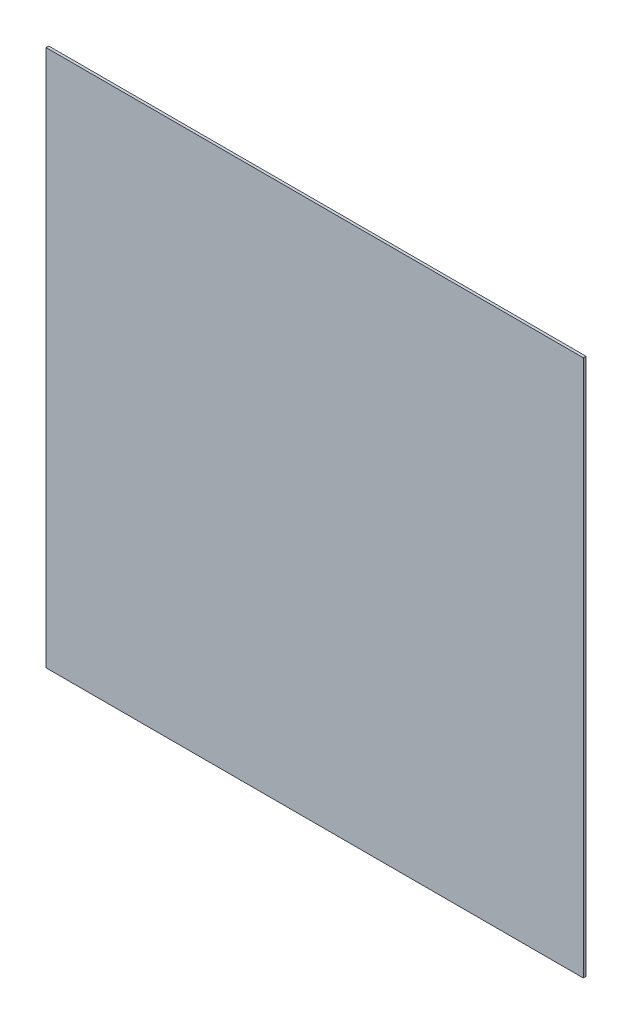
ISO-10303-21;
HEADER;
FILE_DESCRIPTION(('STEP AP214'),'2;1');
FILE_NAME('part.step','',(''),(''),'','','');
FILE_SCHEMA(('AUTOMOTIVE_DESIGN { 1 0 10303 214 1 1 1 1 }'));
ENDSEC;
DATA;
#1=APPLICATION_CONTEXT('core data for automotive mechanical design processes');
#2=APPLICATION_PROTOCOL_DEFINITION('international standard','automotive_design',2000,#1);
#3=PRODUCT_CONTEXT('',#1,'mechanical');
#4=PRODUCT('Part','Part','',(#3));
#5=PRODUCT_RELATED_PRODUCT_CATEGORY('part','',(#4));
#6=PRODUCT_DEFINITION_FORMATION('','',#4);
#7=PRODUCT_DEFINITION_CONTEXT('part definition',#1,'design');
#8=PRODUCT_DEFINITION('design','',#6,#7);
#9=PRODUCT_DEFINITION_SHAPE('','',#8);
#10=(LENGTH_UNIT() NAMED_UNIT(*) SI_UNIT(.MILLI.,.METRE.));
#11=(NAMED_UNIT(*) PLANE_ANGLE_UNIT() SI_UNIT($,.RADIAN.));
#12=(NAMED_UNIT(*) SI_UNIT($,.STERADIAN.) SOLID_ANGLE_UNIT());
#13=UNCERTAINTY_MEASURE_WITH_UNIT(LENGTH_MEASURE(1.E-05),#10,'distance_accuracy_value','');
#14=(GEOMETRIC_REPRESENTATION_CONTEXT(3) GLOBAL_UNCERTAINTY_ASSIGNED_CONTEXT((#13)) GLOBAL_UNIT_ASSIGNED_CONTEXT((#10,
#11,#12)) REPRESENTATION_CONTEXT('',''));
#15=CARTESIAN_POINT('',(0.,0.,0.));
#16=DIRECTION('',(0.,0.,1.));
#17=DIRECTION('',(1.,0.,0.));
#18=AXIS2_PLACEMENT_3D('',#15,#16,#17);
#19=CARTESIAN_POINT('',(0.,600.,0.));
#20=DIRECTION('',(1.,0.,0.));
#21=DIRECTION('',(0.,0.,-1.));
#22=AXIS2_PLACEMENT_3D('',#19,#20,#21);
#23=PLANE('',#22);
#24=DIRECTION('',(0.,0.,1.));
#25=VECTOR('',#24,1.);
#26=CARTESIAN_POINT('',(0.,0.,0.));
#27=LINE('',#26,#25);
#28=CARTESIAN_POINT('',(0.,0.,-3.));
#29=VERTEX_POINT('',#28);
#30=CARTESIAN_POINT('',(0.,0.,0.));
#31=VERTEX_POINT('',#30);
#32=EDGE_CURVE('E96',#29,#31,#27,.T.);
#33=ORIENTED_EDGE('',*,*,#32,.T.);
#34=DIRECTION('',(0.,-1.,0.));
#35=VECTOR('',#34,1.);
#36=CARTESIAN_POINT('',(0.,600.,0.));
#37=LINE('',#36,#35);
#38=CARTESIAN_POINT('',(0.,600.,0.));
#39=VERTEX_POINT('',#38);
#40=EDGE_CURVE('E11',#39,#31,#37,.T.);
#41=ORIENTED_EDGE('',*,*,#40,.F.);
#42=DIRECTION('',(0.,0.,1.));
#43=VECTOR('',#42,1.);
#44=CARTESIAN_POINT('',(0.,600.,0.));
#45=LINE('',#44,#43);
#46=CARTESIAN_POINT('',(0.,600.,-3.));
#47=VERTEX_POINT('',#46);
#48=EDGE_CURVE('E84',#47,#39,#45,.T.);
#49=ORIENTED_EDGE('',*,*,#48,.F.);
#50=DIRECTION('',(0.,-1.,0.));
#51=VECTOR('',#50,1.);
#52=CARTESIAN_POINT('',(0.,600.,-3.));
#53=LINE('',#52,#51);
#54=EDGE_CURVE('E92',#47,#29,#53,.T.);
#55=ORIENTED_EDGE('',*,*,#54,.T.);
#56=EDGE_LOOP('',(#33,#41,#49,#55));
#57=FACE_BOUND('',#56,.T.);
#58=ADVANCED_FACE('F33',(#57),#23,.F.);
#59=CARTESIAN_POINT('',(0.,600.,0.));
#60=DIRECTION('',(0.,0.,-1.));
#61=DIRECTION('',(-1.,0.,0.));
#62=AXIS2_PLACEMENT_3D('',#59,#60,#61);
#63=PLANE('',#62);
#64=DIRECTION('',(1.,0.,0.));
#65=VECTOR('',#64,1.);
#66=CARTESIAN_POINT('',(0.,0.,0.));
#67=LINE('',#66,#65);
#68=CARTESIAN_POINT('',(600.,0.,0.));
#69=VERTEX_POINT('',#68);
#70=EDGE_CURVE('E88',#31,#69,#67,.T.);
#71=ORIENTED_EDGE('',*,*,#70,.T.);
#72=DIRECTION('',(0.,-1.,0.));
#73=VECTOR('',#72,1.);
#74=CARTESIAN_POINT('',(600.,600.,0.));
#75=LINE('',#74,#73);
#76=CARTESIAN_POINT('',(600.,600.,0.));
#77=VERTEX_POINT('',#76);
#78=EDGE_CURVE('E41',#77,#69,#75,.T.);
#79=ORIENTED_EDGE('',*,*,#78,.F.);
#80=DIRECTION('',(1.,0.,0.));
#81=VECTOR('',#80,1.);
#82=CARTESIAN_POINT('',(0.,600.,0.));
#83=LINE('',#82,#81);
#84=EDGE_CURVE('E79',#39,#77,#83,.T.);
#85=ORIENTED_EDGE('',*,*,#84,.F.);
#86=ORIENTED_EDGE('',*,*,#40,.T.);
#87=EDGE_LOOP('',(#71,#79,#85,#86));
#88=FACE_BOUND('',#87,.T.);
#89=ADVANCED_FACE('F87',(#88),#63,.F.);
#90=CARTESIAN_POINT('',(600.,600.,0.));
#91=DIRECTION('',(-1.,0.,0.));
#92=DIRECTION('',(0.,0.,1.));
#93=AXIS2_PLACEMENT_3D('',#90,#91,#92);
#94=PLANE('',#93);
#95=DIRECTION('',(0.,0.,-1.));
#96=VECTOR('',#95,1.);
#97=CARTESIAN_POINT('',(600.,0.,0.));
#98=LINE('',#97,#96);
#99=CARTESIAN_POINT('',(600.,0.,-3.));
#100=VERTEX_POINT('',#99);
#101=EDGE_CURVE('E66',#69,#100,#98,.T.);
#102=ORIENTED_EDGE('',*,*,#101,.T.);
#103=DIRECTION('',(0.,-1.,0.));
#104=VECTOR('',#103,1.);
#105=CARTESIAN_POINT('',(600.,600.,-3.));
#106=LINE('',#105,#104);
#107=CARTESIAN_POINT('',(600.,600.,-3.));
#108=VERTEX_POINT('',#107);
#109=EDGE_CURVE('E89',#108,#100,#106,.T.);
#110=ORIENTED_EDGE('',*,*,#109,.F.);
#111=DIRECTION('',(0.,0.,-1.));
#112=VECTOR('',#111,1.);
#113=CARTESIAN_POINT('',(600.,600.,0.));
#114=LINE('',#113,#112);
#115=EDGE_CURVE('E82',#77,#108,#114,.T.);
#116=ORIENTED_EDGE('',*,*,#115,.F.);
#117=ORIENTED_EDGE('',*,*,#78,.T.);
#118=EDGE_LOOP('',(#102,#110,#116,#117));
#119=FACE_BOUND('',#118,.T.);
#120=ADVANCED_FACE('F90',(#119),#94,.F.);
#121=CARTESIAN_POINT('',(0.,600.,-3.));
#122=DIRECTION('',(0.,0.,1.));
#123=DIRECTION('',(1.,0.,0.));
#124=AXIS2_PLACEMENT_3D('',#121,#122,#123);
#125=PLANE('',#124);
#126=DIRECTION('',(-1.,0.,0.));
#127=VECTOR('',#126,1.);
#128=CARTESIAN_POINT('',(0.,0.,-3.));
#129=LINE('',#128,#127);
#130=EDGE_CURVE('E72',#100,#29,#129,.T.);
#131=ORIENTED_EDGE('',*,*,#130,.T.);
#132=ORIENTED_EDGE('',*,*,#54,.F.);
#133=DIRECTION('',(-1.,0.,0.));
#134=VECTOR('',#133,1.);
#135=CARTESIAN_POINT('',(0.,600.,-3.));
#136=LINE('',#135,#134);
#137=EDGE_CURVE('E49',#108,#47,#136,.T.);
#138=ORIENTED_EDGE('',*,*,#137,.F.);
#139=ORIENTED_EDGE('',*,*,#109,.T.);
#140=EDGE_LOOP('',(#131,#132,#138,#139));
#141=FACE_BOUND('',#140,.T.);
#142=ADVANCED_FACE('F103',(#141),#125,.F.);
#143=CARTESIAN_POINT('',(0.,600.,0.));
#144=DIRECTION('',(0.,-1.,0.));
#145=DIRECTION('',(0.,0.,-1.));
#146=AXIS2_PLACEMENT_3D('',#143,#144,#145);
#147=PLANE('',#146);
#148=ORIENTED_EDGE('',*,*,#48,.T.);
#149=ORIENTED_EDGE('',*,*,#84,.T.);
#150=ORIENTED_EDGE('',*,*,#115,.T.);
#151=ORIENTED_EDGE('',*,*,#137,.T.);
#152=EDGE_LOOP('',(#148,#149,#150,#151));
#153=FACE_BOUND('',#152,.T.);
#154=ADVANCED_FACE('F80',(#153),#147,.F.);
#155=CARTESIAN_POINT('',(0.,0.,0.));
#156=DIRECTION('',(0.,-1.,0.));
#157=DIRECTION('',(0.,0.,-1.));
#158=AXIS2_PLACEMENT_3D('',#155,#156,#157);
#159=PLANE('',#158);
#160=ORIENTED_EDGE('',*,*,#32,.F.);
#161=ORIENTED_EDGE('',*,*,#130,.F.);
#162=ORIENTED_EDGE('',*,*,#101,.F.);
#163=ORIENTED_EDGE('',*,*,#70,.F.);
#164=EDGE_LOOP('',(#160,#161,#162,#163));
#165=FACE_BOUND('',#164,.T.);
#166=ADVANCED_FACE('F106',(#165),#159,.T.);
#167=CLOSED_SHELL('',(#58,#89,#120,#142,#154,#166));
#168=MANIFOLD_SOLID_BREP('B2',#167);
#169=ADVANCED_BREP_SHAPE_REPRESENTATION('',(#18,#168),#14);
#170=SHAPE_DEFINITION_REPRESENTATION(#9,#169);
ENDSEC;
END-ISO-10303-21;
